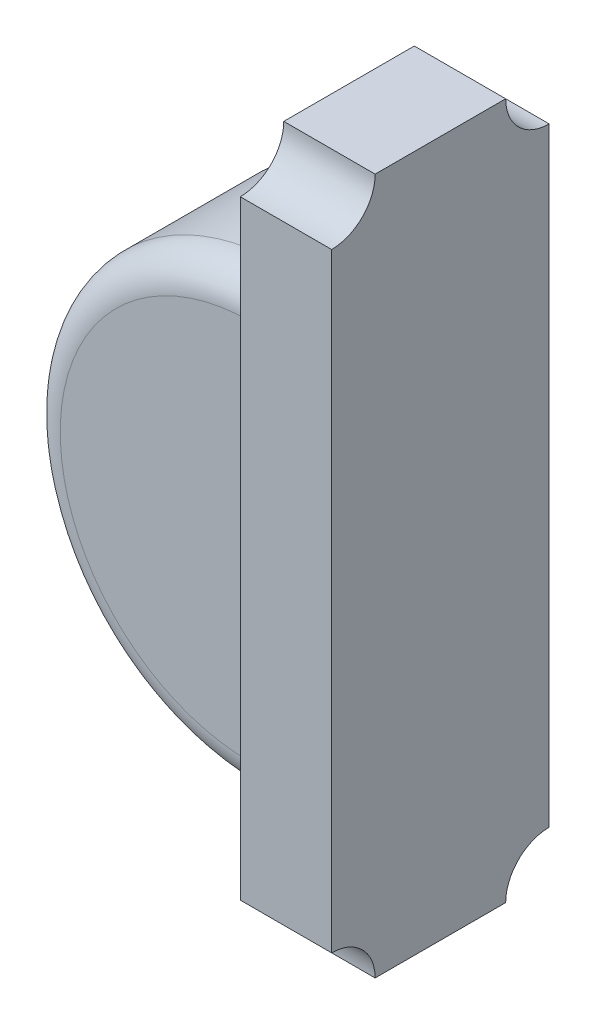
ISO-10303-21;
HEADER;
FILE_DESCRIPTION(('STEP AP214'),'2;1');
FILE_NAME('part.step','',(''),(''),'','','');
FILE_SCHEMA(('AUTOMOTIVE_DESIGN { 1 0 10303 214 1 1 1 1 }'));
ENDSEC;
DATA;
#1=APPLICATION_CONTEXT('core data for automotive mechanical design processes');
#2=APPLICATION_PROTOCOL_DEFINITION('international standard','automotive_design',2000,#1);
#3=PRODUCT_CONTEXT('',#1,'mechanical');
#4=PRODUCT('Part','Part','',(#3));
#5=PRODUCT_RELATED_PRODUCT_CATEGORY('part','',(#4));
#6=PRODUCT_DEFINITION_FORMATION('','',#4);
#7=PRODUCT_DEFINITION_CONTEXT('part definition',#1,'design');
#8=PRODUCT_DEFINITION('design','',#6,#7);
#9=PRODUCT_DEFINITION_SHAPE('','',#8);
#10=(LENGTH_UNIT() NAMED_UNIT(*) SI_UNIT(.MILLI.,.METRE.));
#11=(NAMED_UNIT(*) PLANE_ANGLE_UNIT() SI_UNIT($,.RADIAN.));
#12=(NAMED_UNIT(*) SI_UNIT($,.STERADIAN.) SOLID_ANGLE_UNIT());
#13=UNCERTAINTY_MEASURE_WITH_UNIT(LENGTH_MEASURE(1.E-05),#10,'distance_accuracy_value','');
#14=(GEOMETRIC_REPRESENTATION_CONTEXT(3) GLOBAL_UNCERTAINTY_ASSIGNED_CONTEXT((#13)) GLOBAL_UNIT_ASSIGNED_CONTEXT((#10,
#11,#12)) REPRESENTATION_CONTEXT('',''));
#15=CARTESIAN_POINT('',(0.,0.,0.));
#16=DIRECTION('',(0.,0.,1.));
#17=DIRECTION('',(1.,0.,0.));
#18=AXIS2_PLACEMENT_3D('',#15,#16,#17);
#19=CARTESIAN_POINT('',(-41.47,-15.,1.64999990463257));
#20=DIRECTION('',(0.,0.,1.));
#21=DIRECTION('',(1.,0.,0.));
#22=AXIS2_PLACEMENT_3D('',#19,#20,#21);
#23=CYLINDRICAL_SURFACE('',#22,1.02740882688236);
#24=DIRECTION('',(0.,0.,1.));
#25=VECTOR('',#24,1.);
#26=CARTESIAN_POINT('',(-41.47,-13.9725911731176,1.64999990463257));
#27=LINE('',#26,#25);
#28=CARTESIAN_POINT('',(-41.47,-13.9725911731176,1.79999990463257));
#29=VERTEX_POINT('',#28);
#30=CARTESIAN_POINT('',(-41.47,-13.9725911731176,2.39999990463257));
#31=VERTEX_POINT('',#30);
#32=EDGE_CURVE('E95',#29,#31,#27,.T.);
#33=ORIENTED_EDGE('',*,*,#32,.F.);
#34=CARTESIAN_POINT('',(-41.47,-15.,1.79999990463257));
#35=DIRECTION('',(0.,0.,1.));
#36=DIRECTION('',(1.,0.,0.));
#37=AXIS2_PLACEMENT_3D('',#34,#35,#36);
#38=CIRCLE('',#37,1.02740882688236);
#39=CARTESIAN_POINT('',(-41.47,-16.0274088268824,1.79999990463257));
#40=VERTEX_POINT('',#39);
#41=EDGE_CURVE('E105',#29,#40,#38,.T.);
#42=ORIENTED_EDGE('',*,*,#41,.T.);
#43=DIRECTION('',(0.,0.,1.));
#44=VECTOR('',#43,1.);
#45=CARTESIAN_POINT('',(-41.47,-16.0274088268824,1.64999990463257));
#46=LINE('',#45,#44);
#47=CARTESIAN_POINT('',(-41.47,-16.0274088268824,2.39999990463257));
#48=VERTEX_POINT('',#47);
#49=EDGE_CURVE('E108',#40,#48,#46,.T.);
#50=ORIENTED_EDGE('',*,*,#49,.T.);
#51=CARTESIAN_POINT('',(-41.47,-15.,2.39999990463257));
#52=DIRECTION('',(0.,0.,1.));
#53=DIRECTION('',(1.,0.,0.));
#54=AXIS2_PLACEMENT_3D('',#51,#52,#53);
#55=CIRCLE('',#54,1.02740882688236);
#56=EDGE_CURVE('E107',#48,#31,#55,.F.);
#57=ORIENTED_EDGE('',*,*,#56,.T.);
#58=EDGE_LOOP('',(#33,#42,#50,#57));
#59=FACE_BOUND('',#58,.T.);
#60=ADVANCED_FACE('F53',(#59),#23,.T.);
#61=CARTESIAN_POINT('',(-41.47,-13.9725911731176,1.64999990463257));
#62=DIRECTION('',(1.,0.,0.));
#63=DIRECTION('',(0.,0.,-1.));
#64=AXIS2_PLACEMENT_3D('',#61,#62,#63);
#65=PLANE('',#64);
#66=ORIENTED_EDGE('',*,*,#49,.F.);
#67=CARTESIAN_POINT('',(-41.47,-15.8774088268824,1.79999990463257));
#68=DIRECTION('',(1.,0.,0.));
#69=DIRECTION('',(0.,0.,-1.));
#70=AXIS2_PLACEMENT_3D('',#67,#68,#69);
#71=CIRCLE('',#70,0.15);
#72=CARTESIAN_POINT('',(-41.47,-15.8774088268824,1.64999990463257));
#73=VERTEX_POINT('',#72);
#74=EDGE_CURVE('E73',#40,#73,#71,.T.);
#75=ORIENTED_EDGE('',*,*,#74,.T.);
#76=DIRECTION('',(0.,1.,0.));
#77=VECTOR('',#76,1.);
#78=CARTESIAN_POINT('',(-41.47,-13.9725911731176,1.64999990463257));
#79=LINE('',#78,#77);
#80=CARTESIAN_POINT('',(-41.47,-14.1225911731176,1.64999990463257));
#81=VERTEX_POINT('',#80);
#82=EDGE_CURVE('E97',#73,#81,#79,.T.);
#83=ORIENTED_EDGE('',*,*,#82,.T.);
#84=CARTESIAN_POINT('',(-41.47,-14.1225911731176,1.79999990463257));
#85=DIRECTION('',(1.,0.,0.));
#86=DIRECTION('',(0.,0.,-1.));
#87=AXIS2_PLACEMENT_3D('',#84,#85,#86);
#88=CIRCLE('',#87,0.15);
#89=EDGE_CURVE('E92',#81,#29,#88,.T.);
#90=ORIENTED_EDGE('',*,*,#89,.T.);
#91=ORIENTED_EDGE('',*,*,#32,.T.);
#92=CARTESIAN_POINT('',(-41.47,-14.1225911731176,2.39999990463257));
#93=DIRECTION('',(1.,0.,0.));
#94=DIRECTION('',(0.,0.,-1.));
#95=AXIS2_PLACEMENT_3D('',#92,#93,#94);
#96=CIRCLE('',#95,0.15);
#97=CARTESIAN_POINT('',(-41.47,-14.1225911731176,2.54999990463257));
#98=VERTEX_POINT('',#97);
#99=EDGE_CURVE('E111',#31,#98,#96,.T.);
#100=ORIENTED_EDGE('',*,*,#99,.T.);
#101=DIRECTION('',(0.,1.,0.));
#102=VECTOR('',#101,1.);
#103=CARTESIAN_POINT('',(-41.47,-13.9725911731176,2.54999990463257));
#104=LINE('',#103,#102);
#105=CARTESIAN_POINT('',(-41.47,-15.8774088268824,2.54999990463257));
#106=VERTEX_POINT('',#105);
#107=EDGE_CURVE('E120',#106,#98,#104,.T.);
#108=ORIENTED_EDGE('',*,*,#107,.F.);
#109=CARTESIAN_POINT('',(-41.47,-15.8774088268824,2.39999990463257));
#110=DIRECTION('',(1.,0.,0.));
#111=DIRECTION('',(0.,0.,-1.));
#112=AXIS2_PLACEMENT_3D('',#109,#110,#111);
#113=CIRCLE('',#112,0.15);
#114=EDGE_CURVE('E100',#106,#48,#113,.T.);
#115=ORIENTED_EDGE('',*,*,#114,.T.);
#116=EDGE_LOOP('',(#66,#75,#83,#90,#91,#100,#108,#115));
#117=FACE_BOUND('',#116,.T.);
#118=ADVANCED_FACE('F94',(#117),#65,.T.);
#119=CARTESIAN_POINT('',(-41.47,-15.,1.64999990463257));
#120=DIRECTION('',(0.,0.,1.));
#121=DIRECTION('',(1.,0.,0.));
#122=AXIS2_PLACEMENT_3D('',#119,#120,#121);
#123=PLANE('',#122);
#124=ORIENTED_EDGE('',*,*,#82,.F.);
#125=CARTESIAN_POINT('',(-41.47,-15.,1.64999990463257));
#126=DIRECTION('',(0.,0.,1.));
#127=DIRECTION('',(1.,0.,0.));
#128=AXIS2_PLACEMENT_3D('',#125,#126,#127);
#129=CIRCLE('',#128,0.877408826882362);
#130=EDGE_CURVE('E61',#73,#81,#129,.F.);
#131=ORIENTED_EDGE('',*,*,#130,.T.);
#132=EDGE_LOOP('',(#124,#131));
#133=FACE_BOUND('',#132,.T.);
#134=ADVANCED_FACE('F128',(#133),#123,.F.);
#135=CARTESIAN_POINT('',(-41.47,-15.,2.54999990463257));
#136=DIRECTION('',(0.,0.,1.));
#137=DIRECTION('',(1.,0.,0.));
#138=AXIS2_PLACEMENT_3D('',#135,#136,#137);
#139=PLANE('',#138);
#140=ORIENTED_EDGE('',*,*,#107,.T.);
#141=CARTESIAN_POINT('',(-41.47,-15.,2.54999990463257));
#142=DIRECTION('',(0.,0.,1.));
#143=DIRECTION('',(1.,0.,0.));
#144=AXIS2_PLACEMENT_3D('',#141,#142,#143);
#145=CIRCLE('',#144,0.877408826882362);
#146=EDGE_CURVE('E12',#98,#106,#145,.T.);
#147=ORIENTED_EDGE('',*,*,#146,.T.);
#148=EDGE_LOOP('',(#140,#147));
#149=FACE_BOUND('',#148,.T.);
#150=ADVANCED_FACE('F124',(#149),#139,.T.);
#151=CARTESIAN_POINT('',(-41.47,-15.,1.79999990463257));
#152=DIRECTION('',(0.,0.,1.));
#153=DIRECTION('',(1.,0.,0.));
#154=AXIS2_PLACEMENT_3D('',#151,#152,#153);
#155=TOROIDAL_SURFACE('',#154,0.877408826882362,0.15);
#156=ORIENTED_EDGE('',*,*,#89,.F.);
#157=ORIENTED_EDGE('',*,*,#130,.F.);
#158=ORIENTED_EDGE('',*,*,#74,.F.);
#159=ORIENTED_EDGE('',*,*,#41,.F.);
#160=EDGE_LOOP('',(#156,#157,#158,#159));
#161=FACE_BOUND('',#160,.T.);
#162=ADVANCED_FACE('F110',(#161),#155,.T.);
#163=CARTESIAN_POINT('',(-41.47,-15.,2.39999990463257));
#164=DIRECTION('',(0.,0.,1.));
#165=DIRECTION('',(1.,0.,0.));
#166=AXIS2_PLACEMENT_3D('',#163,#164,#165);
#167=TOROIDAL_SURFACE('',#166,0.877408826882362,0.15);
#168=ORIENTED_EDGE('',*,*,#99,.F.);
#169=ORIENTED_EDGE('',*,*,#56,.F.);
#170=ORIENTED_EDGE('',*,*,#114,.F.);
#171=ORIENTED_EDGE('',*,*,#146,.F.);
#172=EDGE_LOOP('',(#168,#169,#170,#171));
#173=FACE_BOUND('',#172,.T.);
#174=ADVANCED_FACE('F55',(#173),#167,.T.);
#175=CLOSED_SHELL('',(#60,#118,#134,#150,#162,#174));
#176=MANIFOLD_SOLID_BREP('B2',#175);
#177=CARTESIAN_POINT('',(-41.47,-13.4000005722023,2.59999990463257));
#178=DIRECTION('',(1.,0.,0.));
#179=DIRECTION('',(0.,0.,-1.));
#180=AXIS2_PLACEMENT_3D('',#177,#178,#179);
#181=CYLINDRICAL_SURFACE('',#180,0.199999809267411);
#182=CARTESIAN_POINT('',(-41.05,-13.4000005722023,2.59999990463257));
#183=DIRECTION('',(-1.,0.,0.));
#184=DIRECTION('',(0.,0.,-1.));
#185=AXIS2_PLACEMENT_3D('',#182,#183,#184);
#186=CIRCLE('',#185,0.199999809267411);
#187=CARTESIAN_POINT('',(-41.05,-13.3999996185303,2.40000009536743));
#188=VERTEX_POINT('',#187);
#189=CARTESIAN_POINT('',(-41.05,-13.6000003814697,2.59999990463257));
#190=VERTEX_POINT('',#189);
#191=EDGE_CURVE('E274',#188,#190,#186,.T.);
#192=ORIENTED_EDGE('',*,*,#191,.F.);
#193=DIRECTION('',(1.,0.,0.));
#194=VECTOR('',#193,1.);
#195=CARTESIAN_POINT('',(-41.47,-13.3999996185303,2.40000009536743));
#196=LINE('',#195,#194);
#197=CARTESIAN_POINT('',(-41.47,-13.3999996185303,2.40000009536743));
#198=VERTEX_POINT('',#197);
#199=EDGE_CURVE('E51',#198,#188,#196,.T.);
#200=ORIENTED_EDGE('',*,*,#199,.F.);
#201=CARTESIAN_POINT('',(-41.47,-13.4000005722023,2.59999990463257));
#202=DIRECTION('',(-1.,0.,0.));
#203=DIRECTION('',(0.,0.,-1.));
#204=AXIS2_PLACEMENT_3D('',#201,#202,#203);
#205=CIRCLE('',#204,0.199999809267411);
#206=CARTESIAN_POINT('',(-41.47,-13.6000003814697,2.59999990463257));
#207=VERTEX_POINT('',#206);
#208=EDGE_CURVE('E294',#198,#207,#205,.T.);
#209=ORIENTED_EDGE('',*,*,#208,.T.);
#210=DIRECTION('',(1.,0.,0.));
#211=VECTOR('',#210,1.);
#212=CARTESIAN_POINT('',(-41.47,-13.6000003814697,2.59999990463257));
#213=LINE('',#212,#211);
#214=EDGE_CURVE('E180',#207,#190,#213,.T.);
#215=ORIENTED_EDGE('',*,*,#214,.T.);
#216=EDGE_LOOP('',(#192,#200,#209,#215));
#217=FACE_BOUND('',#216,.T.);
#218=ADVANCED_FACE('F177',(#217),#181,.F.);
#219=CARTESIAN_POINT('',(-41.47,-13.3999996185303,2.40000009536743));
#220=DIRECTION('',(0.,1.,0.));
#221=DIRECTION('',(0.,0.,1.));
#222=AXIS2_PLACEMENT_3D('',#219,#220,#221);
#223=PLANE('',#222);
#224=DIRECTION('',(0.,0.,1.));
#225=VECTOR('',#224,1.);
#226=CARTESIAN_POINT('',(-41.05,-13.3999996185303,2.40000009536743));
#227=LINE('',#226,#225);
#228=CARTESIAN_POINT('',(-41.05,-13.3999996185303,1.79999995231628));
#229=VERTEX_POINT('',#228);
#230=EDGE_CURVE('E292',#229,#188,#227,.T.);
#231=ORIENTED_EDGE('',*,*,#230,.F.);
#232=DIRECTION('',(1.,0.,0.));
#233=VECTOR('',#232,1.);
#234=CARTESIAN_POINT('',(-41.47,-13.3999996185303,1.79999995231628));
#235=LINE('',#234,#233);
#236=CARTESIAN_POINT('',(-41.47,-13.3999996185303,1.79999995231628));
#237=VERTEX_POINT('',#236);
#238=EDGE_CURVE('E186',#237,#229,#235,.T.);
#239=ORIENTED_EDGE('',*,*,#238,.F.);
#240=DIRECTION('',(0.,0.,1.));
#241=VECTOR('',#240,1.);
#242=CARTESIAN_POINT('',(-41.47,-13.3999996185303,2.40000009536743));
#243=LINE('',#242,#241);
#244=EDGE_CURVE('E264',#237,#198,#243,.T.);
#245=ORIENTED_EDGE('',*,*,#244,.T.);
#246=ORIENTED_EDGE('',*,*,#199,.T.);
#247=EDGE_LOOP('',(#231,#239,#245,#246));
#248=FACE_BOUND('',#247,.T.);
#249=ADVANCED_FACE('F306',(#248),#223,.T.);
#250=CARTESIAN_POINT('',(-41.47,-13.3999996185303,1.59999918937509));
#251=DIRECTION('',(1.,0.,0.));
#252=DIRECTION('',(0.,0.,-1.));
#253=AXIS2_PLACEMENT_3D('',#250,#251,#252);
#254=CYLINDRICAL_SURFACE('',#253,0.200000762941194);
#255=CARTESIAN_POINT('',(-41.05,-13.3999996185303,1.59999918937509));
#256=DIRECTION('',(-1.,0.,0.));
#257=DIRECTION('',(0.,0.,-1.));
#258=AXIS2_PLACEMENT_3D('',#255,#256,#257);
#259=CIRCLE('',#258,0.200000762941194);
#260=CARTESIAN_POINT('',(-41.05,-13.6000003814697,1.60000002384186));
#261=VERTEX_POINT('',#260);
#262=EDGE_CURVE('E251',#261,#229,#259,.T.);
#263=ORIENTED_EDGE('',*,*,#262,.F.);
#264=DIRECTION('',(1.,0.,0.));
#265=VECTOR('',#264,1.);
#266=CARTESIAN_POINT('',(-41.47,-13.6000003814697,1.60000002384186));
#267=LINE('',#266,#265);
#268=CARTESIAN_POINT('',(-41.47,-13.6000003814697,1.60000002384186));
#269=VERTEX_POINT('',#268);
#270=EDGE_CURVE('E246',#269,#261,#267,.T.);
#271=ORIENTED_EDGE('',*,*,#270,.F.);
#272=CARTESIAN_POINT('',(-41.47,-13.3999996185303,1.59999918937509));
#273=DIRECTION('',(-1.,0.,0.));
#274=DIRECTION('',(0.,0.,-1.));
#275=AXIS2_PLACEMENT_3D('',#272,#273,#274);
#276=CIRCLE('',#275,0.200000762941194);
#277=EDGE_CURVE('E249',#269,#237,#276,.T.);
#278=ORIENTED_EDGE('',*,*,#277,.T.);
#279=ORIENTED_EDGE('',*,*,#238,.T.);
#280=EDGE_LOOP('',(#263,#271,#278,#279));
#281=FACE_BOUND('',#280,.T.);
#282=ADVANCED_FACE('F248',(#281),#254,.F.);
#283=CARTESIAN_POINT('',(-41.47,-13.6000003814697,1.60000002384186));
#284=DIRECTION('',(0.,0.,-1.));
#285=DIRECTION('',(-1.,0.,0.));
#286=AXIS2_PLACEMENT_3D('',#283,#284,#285);
#287=PLANE('',#286);
#288=DIRECTION('',(0.,1.,0.));
#289=VECTOR('',#288,1.);
#290=CARTESIAN_POINT('',(-41.05,-13.6000003814697,1.60000002384186));
#291=LINE('',#290,#289);
#292=CARTESIAN_POINT('',(-41.05,-16.3999996185303,1.60000002384186));
#293=VERTEX_POINT('',#292);
#294=EDGE_CURVE('E289',#293,#261,#291,.T.);
#295=ORIENTED_EDGE('',*,*,#294,.F.);
#296=DIRECTION('',(1.,0.,0.));
#297=VECTOR('',#296,1.);
#298=CARTESIAN_POINT('',(-41.47,-16.3999996185303,1.60000002384186));
#299=LINE('',#298,#297);
#300=CARTESIAN_POINT('',(-41.47,-16.3999996185303,1.60000002384186));
#301=VERTEX_POINT('',#300);
#302=EDGE_CURVE('E256',#301,#293,#299,.T.);
#303=ORIENTED_EDGE('',*,*,#302,.F.);
#304=DIRECTION('',(0.,1.,0.));
#305=VECTOR('',#304,1.);
#306=CARTESIAN_POINT('',(-41.47,-13.6000003814697,1.60000002384186));
#307=LINE('',#306,#305);
#308=EDGE_CURVE('E262',#301,#269,#307,.T.);
#309=ORIENTED_EDGE('',*,*,#308,.T.);
#310=ORIENTED_EDGE('',*,*,#270,.T.);
#311=EDGE_LOOP('',(#295,#303,#309,#310));
#312=FACE_BOUND('',#311,.T.);
#313=ADVANCED_FACE('F266',(#312),#287,.T.);
#314=CARTESIAN_POINT('',(-41.47,-16.5999995470064,1.60000002384186));
#315=DIRECTION('',(1.,0.,0.));
#316=DIRECTION('',(0.,0.,-1.));
#317=AXIS2_PLACEMENT_3D('',#314,#315,#316);
#318=CYLINDRICAL_SURFACE('',#317,0.199999928476167);
#319=CARTESIAN_POINT('',(-41.05,-16.5999995470064,1.60000002384186));
#320=DIRECTION('',(-1.,0.,0.));
#321=DIRECTION('',(0.,0.,-1.));
#322=AXIS2_PLACEMENT_3D('',#319,#320,#321);
#323=CIRCLE('',#322,0.199999928476167);
#324=CARTESIAN_POINT('',(-41.05,-16.6000003814697,1.79999995231628));
#325=VERTEX_POINT('',#324);
#326=EDGE_CURVE('E286',#325,#293,#323,.T.);
#327=ORIENTED_EDGE('',*,*,#326,.F.);
#328=DIRECTION('',(1.,0.,0.));
#329=VECTOR('',#328,1.);
#330=CARTESIAN_POINT('',(-41.47,-16.6000003814697,1.79999995231628));
#331=LINE('',#330,#329);
#332=CARTESIAN_POINT('',(-41.47,-16.6000003814697,1.79999995231628));
#333=VERTEX_POINT('',#332);
#334=EDGE_CURVE('E298',#333,#325,#331,.T.);
#335=ORIENTED_EDGE('',*,*,#334,.F.);
#336=CARTESIAN_POINT('',(-41.47,-16.5999995470064,1.60000002384186));
#337=DIRECTION('',(-1.,0.,0.));
#338=DIRECTION('',(0.,0.,-1.));
#339=AXIS2_PLACEMENT_3D('',#336,#337,#338);
#340=CIRCLE('',#339,0.199999928476167);
#341=EDGE_CURVE('E267',#333,#301,#340,.T.);
#342=ORIENTED_EDGE('',*,*,#341,.T.);
#343=ORIENTED_EDGE('',*,*,#302,.T.);
#344=EDGE_LOOP('',(#327,#335,#342,#343));
#345=FACE_BOUND('',#344,.T.);
#346=ADVANCED_FACE('F319',(#345),#318,.F.);
#347=CARTESIAN_POINT('',(-41.47,-16.6000003814697,2.40000009536743));
#348=DIRECTION('',(0.,-1.,0.));
#349=DIRECTION('',(0.,0.,-1.));
#350=AXIS2_PLACEMENT_3D('',#347,#348,#349);
#351=PLANE('',#350);
#352=DIRECTION('',(0.,0.,-1.));
#353=VECTOR('',#352,1.);
#354=CARTESIAN_POINT('',(-41.05,-16.6000003814697,2.40000009536743));
#355=LINE('',#354,#353);
#356=CARTESIAN_POINT('',(-41.05,-16.6000003814697,2.40000009536743));
#357=VERTEX_POINT('',#356);
#358=EDGE_CURVE('E283',#357,#325,#355,.T.);
#359=ORIENTED_EDGE('',*,*,#358,.F.);
#360=DIRECTION('',(1.,0.,0.));
#361=VECTOR('',#360,1.);
#362=CARTESIAN_POINT('',(-41.47,-16.6000003814697,2.40000009536743));
#363=LINE('',#362,#361);
#364=CARTESIAN_POINT('',(-41.47,-16.6000003814697,2.40000009536743));
#365=VERTEX_POINT('',#364);
#366=EDGE_CURVE('E300',#365,#357,#363,.T.);
#367=ORIENTED_EDGE('',*,*,#366,.F.);
#368=DIRECTION('',(0.,0.,-1.));
#369=VECTOR('',#368,1.);
#370=CARTESIAN_POINT('',(-41.47,-16.6000003814697,2.40000009536743));
#371=LINE('',#370,#369);
#372=EDGE_CURVE('E269',#365,#333,#371,.T.);
#373=ORIENTED_EDGE('',*,*,#372,.T.);
#374=ORIENTED_EDGE('',*,*,#334,.T.);
#375=EDGE_LOOP('',(#359,#367,#373,#374));
#376=FACE_BOUND('',#375,.T.);
#377=ADVANCED_FACE('F322',(#376),#351,.T.);
#378=CARTESIAN_POINT('',(-41.47,-16.5999994277977,2.59999990463257));
#379=DIRECTION('',(1.,0.,0.));
#380=DIRECTION('',(0.,0.,-1.));
#381=AXIS2_PLACEMENT_3D('',#378,#379,#380);
#382=CYLINDRICAL_SURFACE('',#381,0.19999980926741);
#383=CARTESIAN_POINT('',(-41.05,-16.5999994277977,2.59999990463257));
#384=DIRECTION('',(-1.,0.,0.));
#385=DIRECTION('',(0.,0.,1.));
#386=AXIS2_PLACEMENT_3D('',#383,#384,#385);
#387=CIRCLE('',#386,0.19999980926741);
#388=CARTESIAN_POINT('',(-41.05,-16.3999996185303,2.59999990463257));
#389=VERTEX_POINT('',#388);
#390=EDGE_CURVE('E280',#389,#357,#387,.T.);
#391=ORIENTED_EDGE('',*,*,#390,.F.);
#392=DIRECTION('',(1.,0.,0.));
#393=VECTOR('',#392,1.);
#394=CARTESIAN_POINT('',(-41.47,-16.3999996185303,2.59999990463257));
#395=LINE('',#394,#393);
#396=CARTESIAN_POINT('',(-41.47,-16.3999996185303,2.59999990463257));
#397=VERTEX_POINT('',#396);
#398=EDGE_CURVE('E301',#397,#389,#395,.T.);
#399=ORIENTED_EDGE('',*,*,#398,.F.);
#400=CARTESIAN_POINT('',(-41.47,-16.5999994277977,2.59999990463257));
#401=DIRECTION('',(-1.,0.,0.));
#402=DIRECTION('',(0.,0.,1.));
#403=AXIS2_PLACEMENT_3D('',#400,#401,#402);
#404=CIRCLE('',#403,0.19999980926741);
#405=EDGE_CURVE('E397',#397,#365,#404,.T.);
#406=ORIENTED_EDGE('',*,*,#405,.T.);
#407=ORIENTED_EDGE('',*,*,#366,.T.);
#408=EDGE_LOOP('',(#391,#399,#406,#407));
#409=FACE_BOUND('',#408,.T.);
#410=ADVANCED_FACE('F326',(#409),#382,.F.);
#411=CARTESIAN_POINT('',(-41.47,-16.3999996185303,2.59999990463257));
#412=DIRECTION('',(0.,0.,1.));
#413=DIRECTION('',(1.,0.,0.));
#414=AXIS2_PLACEMENT_3D('',#411,#412,#413);
#415=PLANE('',#414);
#416=DIRECTION('',(0.,-1.,0.));
#417=VECTOR('',#416,1.);
#418=CARTESIAN_POINT('',(-41.05,-16.3999996185303,2.59999990463257));
#419=LINE('',#418,#417);
#420=EDGE_CURVE('E277',#190,#389,#419,.T.);
#421=ORIENTED_EDGE('',*,*,#420,.F.);
#422=ORIENTED_EDGE('',*,*,#214,.F.);
#423=DIRECTION('',(0.,-1.,0.));
#424=VECTOR('',#423,1.);
#425=CARTESIAN_POINT('',(-41.47,-16.3999996185303,2.59999990463257));
#426=LINE('',#425,#424);
#427=EDGE_CURVE('E398',#207,#397,#426,.T.);
#428=ORIENTED_EDGE('',*,*,#427,.T.);
#429=ORIENTED_EDGE('',*,*,#398,.T.);
#430=EDGE_LOOP('',(#421,#422,#428,#429));
#431=FACE_BOUND('',#430,.T.);
#432=ADVANCED_FACE('F303',(#431),#415,.T.);
#433=CARTESIAN_POINT('',(-41.47,-13.4000005722023,2.59999990463257));
#434=DIRECTION('',(1.,0.,0.));
#435=DIRECTION('',(0.,0.,-1.));
#436=AXIS2_PLACEMENT_3D('',#433,#434,#435);
#437=PLANE('',#436);
#438=ORIENTED_EDGE('',*,*,#208,.F.);
#439=ORIENTED_EDGE('',*,*,#244,.F.);
#440=ORIENTED_EDGE('',*,*,#277,.F.);
#441=ORIENTED_EDGE('',*,*,#308,.F.);
#442=ORIENTED_EDGE('',*,*,#341,.F.);
#443=ORIENTED_EDGE('',*,*,#372,.F.);
#444=ORIENTED_EDGE('',*,*,#405,.F.);
#445=ORIENTED_EDGE('',*,*,#427,.F.);
#446=EDGE_LOOP('',(#438,#439,#440,#441,#442,#443,#444,#445));
#447=FACE_BOUND('',#446,.T.);
#448=ADVANCED_FACE('F260',(#447),#437,.F.);
#449=CARTESIAN_POINT('',(-41.05,-13.4000005722023,2.59999990463257));
#450=DIRECTION('',(1.,0.,0.));
#451=DIRECTION('',(0.,0.,-1.));
#452=AXIS2_PLACEMENT_3D('',#449,#450,#451);
#453=PLANE('',#452);
#454=ORIENTED_EDGE('',*,*,#191,.T.);
#455=ORIENTED_EDGE('',*,*,#420,.T.);
#456=ORIENTED_EDGE('',*,*,#390,.T.);
#457=ORIENTED_EDGE('',*,*,#358,.T.);
#458=ORIENTED_EDGE('',*,*,#326,.T.);
#459=ORIENTED_EDGE('',*,*,#294,.T.);
#460=ORIENTED_EDGE('',*,*,#262,.T.);
#461=ORIENTED_EDGE('',*,*,#230,.T.);
#462=EDGE_LOOP('',(#454,#455,#456,#457,#458,#459,#460,#461));
#463=FACE_BOUND('',#462,.T.);
#464=ADVANCED_FACE('F305',(#463),#453,.T.);
#465=CLOSED_SHELL('',(#218,#249,#282,#313,#346,#377,#410,#432,#448,#464));
#466=MANIFOLD_SOLID_BREP('B6',#465);
#467=ADVANCED_BREP_SHAPE_REPRESENTATION('',(#18,#176,#466),#14);
#468=SHAPE_DEFINITION_REPRESENTATION(#9,#467);
ENDSEC;
END-ISO-10303-21;
